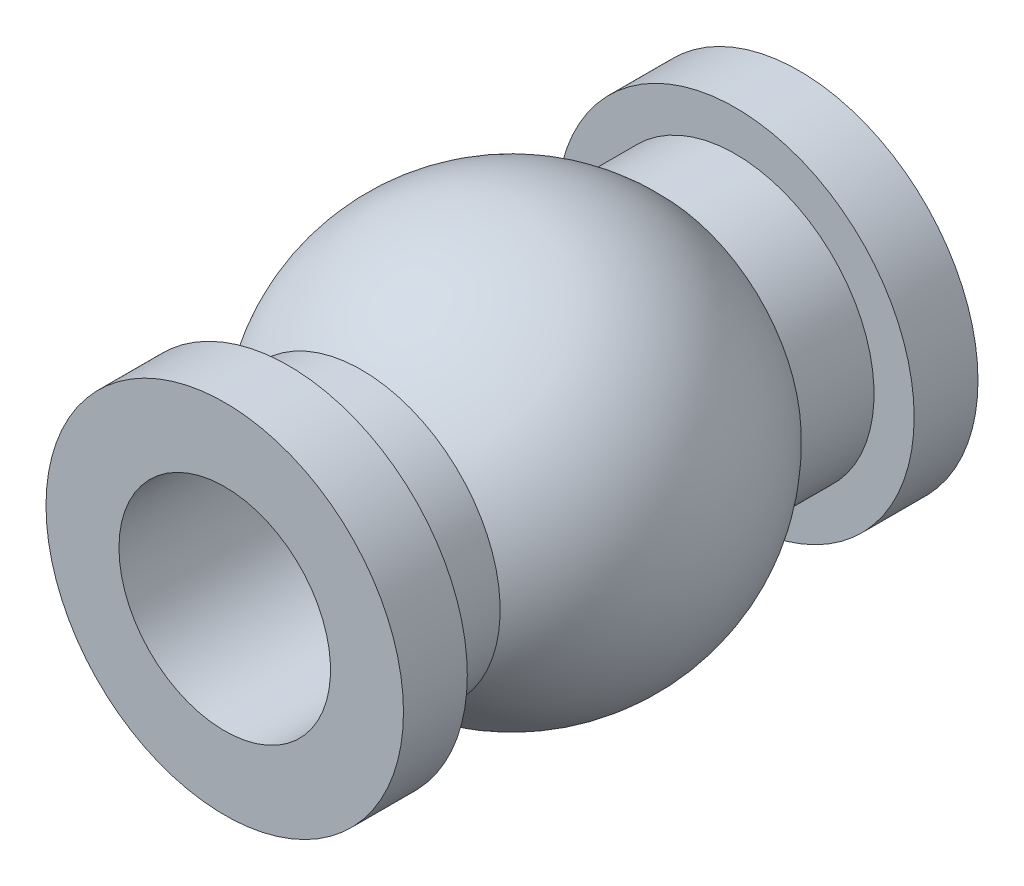
ISO-10303-21;
HEADER;
FILE_DESCRIPTION(('STEP AP214'),'2;1');
FILE_NAME('part.step','',(''),(''),'','','');
FILE_SCHEMA(('AUTOMOTIVE_DESIGN { 1 0 10303 214 1 1 1 1 }'));
ENDSEC;
DATA;
#1=APPLICATION_CONTEXT('core data for automotive mechanical design processes');
#2=APPLICATION_PROTOCOL_DEFINITION('international standard','automotive_design',2000,#1);
#3=PRODUCT_CONTEXT('',#1,'mechanical');
#4=PRODUCT('Part','Part','',(#3));
#5=PRODUCT_RELATED_PRODUCT_CATEGORY('part','',(#4));
#6=PRODUCT_DEFINITION_FORMATION('','',#4);
#7=PRODUCT_DEFINITION_CONTEXT('part definition',#1,'design');
#8=PRODUCT_DEFINITION('design','',#6,#7);
#9=PRODUCT_DEFINITION_SHAPE('','',#8);
#10=(LENGTH_UNIT() NAMED_UNIT(*) SI_UNIT(.MILLI.,.METRE.));
#11=(NAMED_UNIT(*) PLANE_ANGLE_UNIT() SI_UNIT($,.RADIAN.));
#12=(NAMED_UNIT(*) SI_UNIT($,.STERADIAN.) SOLID_ANGLE_UNIT());
#13=UNCERTAINTY_MEASURE_WITH_UNIT(LENGTH_MEASURE(1.E-05),#10,'distance_accuracy_value','');
#14=(GEOMETRIC_REPRESENTATION_CONTEXT(3) GLOBAL_UNCERTAINTY_ASSIGNED_CONTEXT((#13)) GLOBAL_UNIT_ASSIGNED_CONTEXT((#10,
#11,#12)) REPRESENTATION_CONTEXT('',''));
#15=CARTESIAN_POINT('',(0.,0.,0.));
#16=DIRECTION('',(0.,0.,1.));
#17=DIRECTION('',(1.,0.,0.));
#18=AXIS2_PLACEMENT_3D('',#15,#16,#17);
#19=CARTESIAN_POINT('',(1.4732,0.,-4.0005));
#20=DIRECTION('',(0.,0.,1.));
#21=DIRECTION('',(1.,0.,0.));
#22=AXIS2_PLACEMENT_3D('',#19,#20,#21);
#23=PLANE('',#22);
#24=CARTESIAN_POINT('',(0.,0.,-4.0005));
#25=DIRECTION('',(0.,0.,-1.));
#26=DIRECTION('',(-1.,0.,0.));
#27=AXIS2_PLACEMENT_3D('',#24,#25,#26);
#28=CIRCLE('',#27,1.4732);
#29=CARTESIAN_POINT('',(-1.4732,0.,-4.0005));
#30=VERTEX_POINT('',#29);
#31=EDGE_CURVE('E10',#30,#30,#28,.T.);
#32=ORIENTED_EDGE('',*,*,#31,.F.);
#33=EDGE_LOOP('',(#32));
#34=FACE_BOUND('',#33,.T.);
#35=CARTESIAN_POINT('',(0.,0.,-4.0005));
#36=DIRECTION('',(0.,0.,-1.));
#37=DIRECTION('',(-1.,0.,0.));
#38=AXIS2_PLACEMENT_3D('',#35,#36,#37);
#39=CIRCLE('',#38,2.4892);
#40=CARTESIAN_POINT('',(-2.4892,0.,-4.0005));
#41=VERTEX_POINT('',#40);
#42=EDGE_CURVE('E66',#41,#41,#39,.T.);
#43=ORIENTED_EDGE('',*,*,#42,.T.);
#44=EDGE_LOOP('',(#43));
#45=FACE_BOUND('',#44,.T.);
#46=ADVANCED_FACE('F32',(#34,#45),#23,.F.);
#47=CARTESIAN_POINT('',(0.,0.,-2.77301362109483));
#48=DIRECTION('',(0.,0.,-1.));
#49=DIRECTION('',(-1.,0.,0.));
#50=AXIS2_PLACEMENT_3D('',#47,#48,#49);
#51=CYLINDRICAL_SURFACE('',#50,1.4732);
#52=CARTESIAN_POINT('',(0.,0.,4.0005));
#53=DIRECTION('',(0.,0.,-1.));
#54=DIRECTION('',(-1.,0.,0.));
#55=AXIS2_PLACEMENT_3D('',#52,#53,#54);
#56=CIRCLE('',#55,1.4732);
#57=CARTESIAN_POINT('',(-1.4732,0.,4.0005));
#58=VERTEX_POINT('',#57);
#59=EDGE_CURVE('E38',#58,#58,#56,.T.);
#60=ORIENTED_EDGE('',*,*,#59,.F.);
#61=EDGE_LOOP('',(#60));
#62=FACE_BOUND('',#61,.T.);
#63=ORIENTED_EDGE('',*,*,#31,.T.);
#64=EDGE_LOOP('',(#63));
#65=FACE_BOUND('',#64,.T.);
#66=ADVANCED_FACE('F115',(#62,#65),#51,.F.);
#67=CARTESIAN_POINT('',(1.4732,0.,4.0005));
#68=DIRECTION('',(0.,0.,-1.));
#69=DIRECTION('',(-1.,0.,0.));
#70=AXIS2_PLACEMENT_3D('',#67,#68,#69);
#71=PLANE('',#70);
#72=CARTESIAN_POINT('',(0.,0.,4.0005));
#73=DIRECTION('',(0.,0.,-1.));
#74=DIRECTION('',(-1.,0.,0.));
#75=AXIS2_PLACEMENT_3D('',#72,#73,#74);
#76=CIRCLE('',#75,2.4892);
#77=CARTESIAN_POINT('',(-2.4892,0.,4.0005));
#78=VERTEX_POINT('',#77);
#79=EDGE_CURVE('E42',#78,#78,#76,.T.);
#80=ORIENTED_EDGE('',*,*,#79,.F.);
#81=EDGE_LOOP('',(#80));
#82=FACE_BOUND('',#81,.T.);
#83=ORIENTED_EDGE('',*,*,#59,.T.);
#84=EDGE_LOOP('',(#83));
#85=FACE_BOUND('',#84,.T.);
#86=ADVANCED_FACE('F110',(#82,#85),#71,.F.);
#87=CARTESIAN_POINT('',(0.,0.,-2.77301362109483));
#88=DIRECTION('',(0.,0.,-1.));
#89=DIRECTION('',(-1.,0.,0.));
#90=AXIS2_PLACEMENT_3D('',#87,#88,#89);
#91=CYLINDRICAL_SURFACE('',#90,2.4892);
#92=CARTESIAN_POINT('',(0.,0.,3.1115));
#93=DIRECTION('',(0.,0.,-1.));
#94=DIRECTION('',(-1.,0.,0.));
#95=AXIS2_PLACEMENT_3D('',#92,#93,#94);
#96=CIRCLE('',#95,2.4892);
#97=CARTESIAN_POINT('',(-2.4892,0.,3.1115));
#98=VERTEX_POINT('',#97);
#99=EDGE_CURVE('E46',#98,#98,#96,.T.);
#100=ORIENTED_EDGE('',*,*,#99,.F.);
#101=EDGE_LOOP('',(#100));
#102=FACE_BOUND('',#101,.T.);
#103=ORIENTED_EDGE('',*,*,#79,.T.);
#104=EDGE_LOOP('',(#103));
#105=FACE_BOUND('',#104,.T.);
#106=ADVANCED_FACE('F104',(#102,#105),#91,.T.);
#107=CARTESIAN_POINT('',(2.4892,0.,3.1115));
#108=DIRECTION('',(0.,0.,1.));
#109=DIRECTION('',(1.,0.,0.));
#110=AXIS2_PLACEMENT_3D('',#107,#108,#109);
#111=PLANE('',#110);
#112=CARTESIAN_POINT('',(0.,0.,3.1115));
#113=DIRECTION('',(0.,0.,-1.));
#114=DIRECTION('',(-1.,0.,0.));
#115=AXIS2_PLACEMENT_3D('',#112,#113,#114);
#116=CIRCLE('',#115,1.9304);
#117=CARTESIAN_POINT('',(-1.9304,0.,3.1115));
#118=VERTEX_POINT('',#117);
#119=EDGE_CURVE('E51',#118,#118,#116,.T.);
#120=ORIENTED_EDGE('',*,*,#119,.F.);
#121=EDGE_LOOP('',(#120));
#122=FACE_BOUND('',#121,.T.);
#123=ORIENTED_EDGE('',*,*,#99,.T.);
#124=EDGE_LOOP('',(#123));
#125=FACE_BOUND('',#124,.T.);
#126=ADVANCED_FACE('F98',(#122,#125),#111,.F.);
#127=CARTESIAN_POINT('',(0.,0.,-2.77301362109483));
#128=DIRECTION('',(0.,0.,-1.));
#129=DIRECTION('',(-1.,0.,0.));
#130=AXIS2_PLACEMENT_3D('',#127,#128,#129);
#131=CYLINDRICAL_SURFACE('',#130,1.9304);
#132=CARTESIAN_POINT('',(0.,0.,2.0955));
#133=DIRECTION('',(0.,0.,-1.));
#134=DIRECTION('',(-1.,0.,0.));
#135=AXIS2_PLACEMENT_3D('',#132,#133,#134);
#136=CIRCLE('',#135,1.9304);
#137=CARTESIAN_POINT('',(-1.9304,0.,2.0955));
#138=VERTEX_POINT('',#137);
#139=EDGE_CURVE('E54',#138,#138,#136,.T.);
#140=ORIENTED_EDGE('',*,*,#139,.F.);
#141=EDGE_LOOP('',(#140));
#142=FACE_BOUND('',#141,.T.);
#143=ORIENTED_EDGE('',*,*,#119,.T.);
#144=EDGE_LOOP('',(#143));
#145=FACE_BOUND('',#144,.T.);
#146=ADVANCED_FACE('F92',(#142,#145),#131,.T.);
#147=CARTESIAN_POINT('',(0.,0.,0.));
#148=DIRECTION('',(0.,0.,-1.));
#149=DIRECTION('',(1.,0.,0.));
#150=AXIS2_PLACEMENT_3D('',#147,#148,#149);
#151=SPHERICAL_SURFACE('',#150,2.84913397543885);
#152=CARTESIAN_POINT('',(0.,0.,-2.0955));
#153=DIRECTION('',(0.,0.,-1.));
#154=DIRECTION('',(-1.,0.,0.));
#155=AXIS2_PLACEMENT_3D('',#152,#153,#154);
#156=CIRCLE('',#155,1.9304);
#157=CARTESIAN_POINT('',(-1.9304,0.,-2.0955));
#158=VERTEX_POINT('',#157);
#159=EDGE_CURVE('E57',#158,#158,#156,.T.);
#160=ORIENTED_EDGE('',*,*,#159,.F.);
#161=EDGE_LOOP('',(#160));
#162=FACE_BOUND('',#161,.T.);
#163=ORIENTED_EDGE('',*,*,#139,.T.);
#164=EDGE_LOOP('',(#163));
#165=FACE_BOUND('',#164,.T.);
#166=ADVANCED_FACE('F86',(#162,#165),#151,.T.);
#167=CARTESIAN_POINT('',(0.,0.,-2.77301362109483));
#168=DIRECTION('',(0.,0.,-1.));
#169=DIRECTION('',(-1.,0.,0.));
#170=AXIS2_PLACEMENT_3D('',#167,#168,#169);
#171=CYLINDRICAL_SURFACE('',#170,1.9304);
#172=CARTESIAN_POINT('',(0.,0.,-3.1115));
#173=DIRECTION('',(0.,0.,-1.));
#174=DIRECTION('',(-1.,0.,0.));
#175=AXIS2_PLACEMENT_3D('',#172,#173,#174);
#176=CIRCLE('',#175,1.9304);
#177=CARTESIAN_POINT('',(-1.9304,0.,-3.1115));
#178=VERTEX_POINT('',#177);
#179=EDGE_CURVE('E60',#178,#178,#176,.T.);
#180=ORIENTED_EDGE('',*,*,#179,.F.);
#181=EDGE_LOOP('',(#180));
#182=FACE_BOUND('',#181,.T.);
#183=ORIENTED_EDGE('',*,*,#159,.T.);
#184=EDGE_LOOP('',(#183));
#185=FACE_BOUND('',#184,.T.);
#186=ADVANCED_FACE('F80',(#182,#185),#171,.T.);
#187=CARTESIAN_POINT('',(1.9304,0.,-3.1115));
#188=DIRECTION('',(0.,0.,-1.));
#189=DIRECTION('',(-1.,0.,0.));
#190=AXIS2_PLACEMENT_3D('',#187,#188,#189);
#191=PLANE('',#190);
#192=CARTESIAN_POINT('',(0.,0.,-3.1115));
#193=DIRECTION('',(0.,0.,-1.));
#194=DIRECTION('',(-1.,0.,0.));
#195=AXIS2_PLACEMENT_3D('',#192,#193,#194);
#196=CIRCLE('',#195,2.4892);
#197=CARTESIAN_POINT('',(-2.4892,0.,-3.1115));
#198=VERTEX_POINT('',#197);
#199=EDGE_CURVE('E63',#198,#198,#196,.T.);
#200=ORIENTED_EDGE('',*,*,#199,.F.);
#201=EDGE_LOOP('',(#200));
#202=FACE_BOUND('',#201,.T.);
#203=ORIENTED_EDGE('',*,*,#179,.T.);
#204=EDGE_LOOP('',(#203));
#205=FACE_BOUND('',#204,.T.);
#206=ADVANCED_FACE('F74',(#202,#205),#191,.F.);
#207=CARTESIAN_POINT('',(0.,0.,-2.77301362109483));
#208=DIRECTION('',(0.,0.,-1.));
#209=DIRECTION('',(-1.,0.,0.));
#210=AXIS2_PLACEMENT_3D('',#207,#208,#209);
#211=CYLINDRICAL_SURFACE('',#210,2.4892);
#212=ORIENTED_EDGE('',*,*,#42,.F.);
#213=EDGE_LOOP('',(#212));
#214=FACE_BOUND('',#213,.T.);
#215=ORIENTED_EDGE('',*,*,#199,.T.);
#216=EDGE_LOOP('',(#215));
#217=FACE_BOUND('',#216,.T.);
#218=ADVANCED_FACE('F71',(#214,#217),#211,.T.);
#219=CLOSED_SHELL('',(#46,#66,#86,#106,#126,#146,#166,#186,#206,#218));
#220=MANIFOLD_SOLID_BREP('B2',#219);
#221=ADVANCED_BREP_SHAPE_REPRESENTATION('',(#18,#220),#14);
#222=SHAPE_DEFINITION_REPRESENTATION(#9,#221);
ENDSEC;
END-ISO-10303-21;
